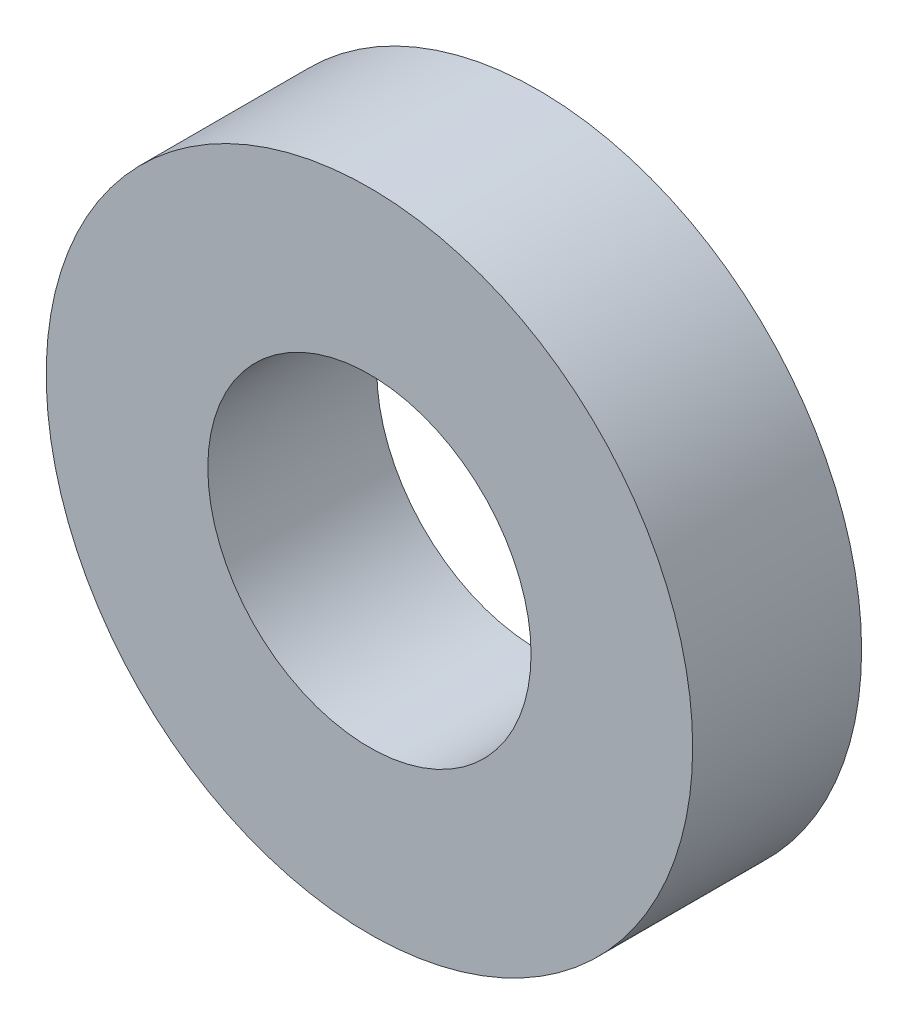
ISO-10303-21;
HEADER;
FILE_DESCRIPTION(('STEP AP214'),'2;1');
FILE_NAME('part.step','',(''),(''),'','','');
FILE_SCHEMA(('AUTOMOTIVE_DESIGN { 1 0 10303 214 1 1 1 1 }'));
ENDSEC;
DATA;
#1=APPLICATION_CONTEXT('core data for automotive mechanical design processes');
#2=APPLICATION_PROTOCOL_DEFINITION('international standard','automotive_design',2000,#1);
#3=PRODUCT_CONTEXT('',#1,'mechanical');
#4=PRODUCT('Part','Part','',(#3));
#5=PRODUCT_RELATED_PRODUCT_CATEGORY('part','',(#4));
#6=PRODUCT_DEFINITION_FORMATION('','',#4);
#7=PRODUCT_DEFINITION_CONTEXT('part definition',#1,'design');
#8=PRODUCT_DEFINITION('design','',#6,#7);
#9=PRODUCT_DEFINITION_SHAPE('','',#8);
#10=(LENGTH_UNIT() NAMED_UNIT(*) SI_UNIT(.MILLI.,.METRE.));
#11=(NAMED_UNIT(*) PLANE_ANGLE_UNIT() SI_UNIT($,.RADIAN.));
#12=(NAMED_UNIT(*) SI_UNIT($,.STERADIAN.) SOLID_ANGLE_UNIT());
#13=UNCERTAINTY_MEASURE_WITH_UNIT(LENGTH_MEASURE(1.E-05),#10,'distance_accuracy_value','');
#14=(GEOMETRIC_REPRESENTATION_CONTEXT(3) GLOBAL_UNCERTAINTY_ASSIGNED_CONTEXT((#13)) GLOBAL_UNIT_ASSIGNED_CONTEXT((#10,
#11,#12)) REPRESENTATION_CONTEXT('',''));
#15=CARTESIAN_POINT('',(0.,0.,0.));
#16=DIRECTION('',(0.,0.,1.));
#17=DIRECTION('',(1.,0.,0.));
#18=AXIS2_PLACEMENT_3D('',#15,#16,#17);
#19=CARTESIAN_POINT('',(0.,0.,4.9784));
#20=DIRECTION('',(0.,0.,1.));
#21=DIRECTION('',(1.,0.,0.));
#22=AXIS2_PLACEMENT_3D('',#19,#20,#21);
#23=PLANE('',#22);
#24=CARTESIAN_POINT('',(0.,0.,4.9784));
#25=DIRECTION('',(0.,0.,1.));
#26=DIRECTION('',(1.,0.,0.));
#27=AXIS2_PLACEMENT_3D('',#24,#25,#26);
#28=CIRCLE('',#27,9.525);
#29=CARTESIAN_POINT('',(9.525,0.,4.9784));
#30=VERTEX_POINT('',#29);
#31=EDGE_CURVE('E10',#30,#30,#28,.T.);
#32=ORIENTED_EDGE('',*,*,#31,.T.);
#33=EDGE_LOOP('',(#32));
#34=FACE_BOUND('',#33,.T.);
#35=CARTESIAN_POINT('',(0.,0.,4.9784));
#36=DIRECTION('',(0.,0.,1.));
#37=DIRECTION('',(1.,0.,0.));
#38=AXIS2_PLACEMENT_3D('',#35,#36,#37);
#39=CIRCLE('',#38,4.7625);
#40=CARTESIAN_POINT('',(4.7625,0.,4.9784));
#41=VERTEX_POINT('',#40);
#42=EDGE_CURVE('E42',#41,#41,#39,.T.);
#43=ORIENTED_EDGE('',*,*,#42,.F.);
#44=EDGE_LOOP('',(#43));
#45=FACE_BOUND('',#44,.T.);
#46=ADVANCED_FACE('F31',(#34,#45),#23,.T.);
#47=CARTESIAN_POINT('',(0.,0.,0.));
#48=DIRECTION('',(0.,0.,1.));
#49=DIRECTION('',(1.,0.,0.));
#50=AXIS2_PLACEMENT_3D('',#47,#48,#49);
#51=PLANE('',#50);
#52=CARTESIAN_POINT('',(0.,0.,0.));
#53=DIRECTION('',(0.,0.,1.));
#54=DIRECTION('',(1.,0.,0.));
#55=AXIS2_PLACEMENT_3D('',#52,#53,#54);
#56=CIRCLE('',#55,9.525);
#57=CARTESIAN_POINT('',(9.525,0.,0.));
#58=VERTEX_POINT('',#57);
#59=EDGE_CURVE('E35',#58,#58,#56,.T.);
#60=ORIENTED_EDGE('',*,*,#59,.F.);
#61=EDGE_LOOP('',(#60));
#62=FACE_BOUND('',#61,.T.);
#63=CARTESIAN_POINT('',(0.,0.,0.));
#64=DIRECTION('',(0.,0.,1.));
#65=DIRECTION('',(1.,0.,0.));
#66=AXIS2_PLACEMENT_3D('',#63,#64,#65);
#67=CIRCLE('',#66,4.7625);
#68=CARTESIAN_POINT('',(4.7625,0.,0.));
#69=VERTEX_POINT('',#68);
#70=EDGE_CURVE('E44',#69,#69,#67,.T.);
#71=ORIENTED_EDGE('',*,*,#70,.T.);
#72=EDGE_LOOP('',(#71));
#73=FACE_BOUND('',#72,.T.);
#74=ADVANCED_FACE('F54',(#62,#73),#51,.F.);
#75=CARTESIAN_POINT('',(0.,0.,4.9784));
#76=DIRECTION('',(0.,0.,-1.));
#77=DIRECTION('',(-1.,0.,0.));
#78=AXIS2_PLACEMENT_3D('',#75,#76,#77);
#79=CYLINDRICAL_SURFACE('',#78,9.525);
#80=ORIENTED_EDGE('',*,*,#31,.F.);
#81=EDGE_LOOP('',(#80));
#82=FACE_BOUND('',#81,.T.);
#83=ORIENTED_EDGE('',*,*,#59,.T.);
#84=EDGE_LOOP('',(#83));
#85=FACE_BOUND('',#84,.T.);
#86=ADVANCED_FACE('F33',(#82,#85),#79,.T.);
#87=CARTESIAN_POINT('',(0.,0.,4.9784));
#88=DIRECTION('',(0.,0.,-1.));
#89=DIRECTION('',(-1.,0.,0.));
#90=AXIS2_PLACEMENT_3D('',#87,#88,#89);
#91=CYLINDRICAL_SURFACE('',#90,4.7625);
#92=ORIENTED_EDGE('',*,*,#42,.T.);
#93=EDGE_LOOP('',(#92));
#94=FACE_BOUND('',#93,.T.);
#95=ORIENTED_EDGE('',*,*,#70,.F.);
#96=EDGE_LOOP('',(#95));
#97=FACE_BOUND('',#96,.T.);
#98=ADVANCED_FACE('F50',(#94,#97),#91,.F.);
#99=CLOSED_SHELL('',(#46,#74,#86,#98));
#100=MANIFOLD_SOLID_BREP('B2',#99);
#101=ADVANCED_BREP_SHAPE_REPRESENTATION('',(#18,#100),#14);
#102=SHAPE_DEFINITION_REPRESENTATION(#9,#101);
ENDSEC;
END-ISO-10303-21;
